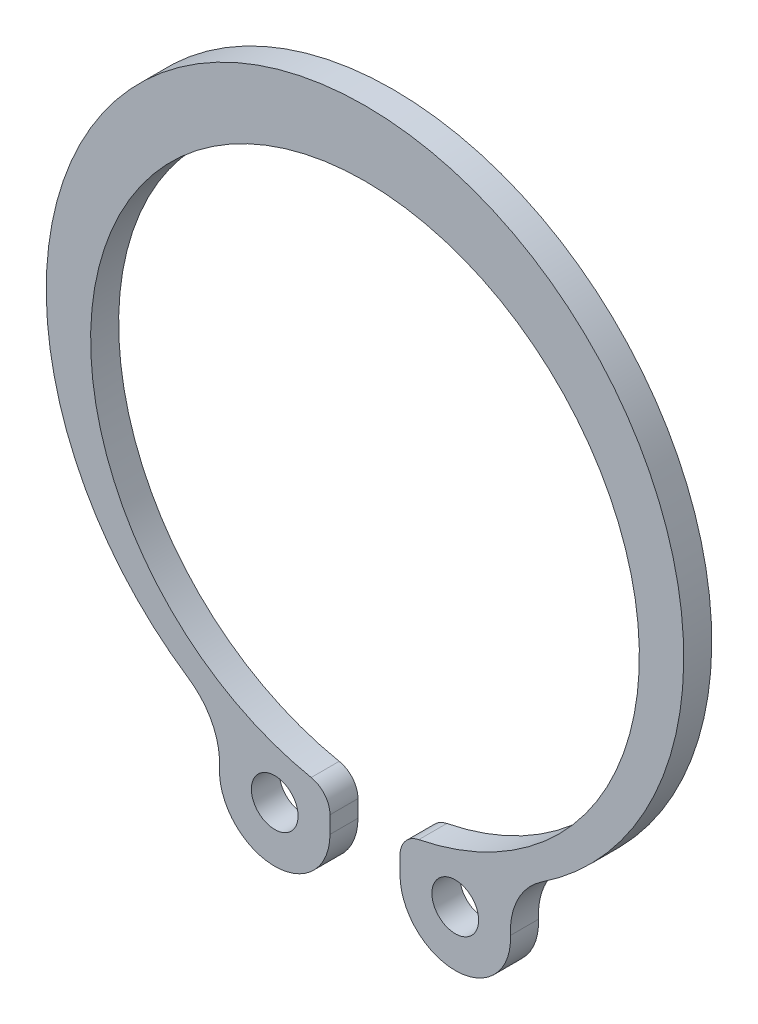
ISO-10303-21;
HEADER;
FILE_DESCRIPTION(('STEP AP214'),'2;1');
FILE_NAME('part.step','',(''),(''),'','','');
FILE_SCHEMA(('AUTOMOTIVE_DESIGN { 1 0 10303 214 1 1 1 1 }'));
ENDSEC;
DATA;
#1=APPLICATION_CONTEXT('core data for automotive mechanical design processes');
#2=APPLICATION_PROTOCOL_DEFINITION('international standard','automotive_design',2000,#1);
#3=PRODUCT_CONTEXT('',#1,'mechanical');
#4=PRODUCT('Part','Part','',(#3));
#5=PRODUCT_RELATED_PRODUCT_CATEGORY('part','',(#4));
#6=PRODUCT_DEFINITION_FORMATION('','',#4);
#7=PRODUCT_DEFINITION_CONTEXT('part definition',#1,'design');
#8=PRODUCT_DEFINITION('design','',#6,#7);
#9=PRODUCT_DEFINITION_SHAPE('','',#8);
#10=(LENGTH_UNIT() NAMED_UNIT(*) SI_UNIT(.MILLI.,.METRE.));
#11=(NAMED_UNIT(*) PLANE_ANGLE_UNIT() SI_UNIT($,.RADIAN.));
#12=(NAMED_UNIT(*) SI_UNIT($,.STERADIAN.) SOLID_ANGLE_UNIT());
#13=UNCERTAINTY_MEASURE_WITH_UNIT(LENGTH_MEASURE(1.E-05),#10,'distance_accuracy_value','');
#14=(GEOMETRIC_REPRESENTATION_CONTEXT(3) GLOBAL_UNCERTAINTY_ASSIGNED_CONTEXT((#13)) GLOBAL_UNIT_ASSIGNED_CONTEXT((#10,
#11,#12)) REPRESENTATION_CONTEXT('',''));
#15=CARTESIAN_POINT('',(0.,0.,0.));
#16=DIRECTION('',(0.,0.,1.));
#17=DIRECTION('',(1.,0.,0.));
#18=AXIS2_PLACEMENT_3D('',#15,#16,#17);
#19=CARTESIAN_POINT('',(2.5,-13.40249975005,1.2));
#20=DIRECTION('',(0.,0.,1.));
#21=DIRECTION('',(1.,0.,0.));
#22=AXIS2_PLACEMENT_3D('',#19,#20,#21);
#23=PLANE('',#22);
#24=CARTESIAN_POINT('',(-3.86605014820735,-14.1306813795919,1.2));
#25=DIRECTION('',(0.,0.,1.));
#26=DIRECTION('',(1.,0.,0.));
#27=AXIS2_PLACEMENT_3D('',#24,#25,#26);
#28=CIRCLE('',#27,1.);
#29=CARTESIAN_POINT('',(-2.86605014820735,-14.1306813795919,1.2));
#30=VERTEX_POINT('',#29);
#31=EDGE_CURVE('E147',#30,#30,#28,.T.);
#32=ORIENTED_EDGE('',*,*,#31,.F.);
#33=EDGE_LOOP('',(#32));
#34=FACE_BOUND('',#33,.T.);
#35=CARTESIAN_POINT('',(2.5,-13.40249975005,1.2));
#36=DIRECTION('',(0.,0.,1.));
#37=DIRECTION('',(1.,0.,0.));
#38=AXIS2_PLACEMENT_3D('',#35,#36,#37);
#39=CIRCLE('',#38,1.);
#40=CARTESIAN_POINT('',(2.30392156862744,-12.4219115343598,1.2));
#41=VERTEX_POINT('',#40);
#42=CARTESIAN_POINT('',(1.5,-13.40249975005,1.2));
#43=VERTEX_POINT('',#42);
#44=EDGE_CURVE('E162',#41,#43,#39,.T.);
#45=ORIENTED_EDGE('',*,*,#44,.T.);
#46=DIRECTION('',(0.,-1.,0.));
#47=VECTOR('',#46,1.);
#48=CARTESIAN_POINT('',(1.5,-14.1306813795919,1.2));
#49=LINE('',#48,#47);
#50=CARTESIAN_POINT('',(1.5,-14.1306813795919,1.2));
#51=VERTEX_POINT('',#50);
#52=EDGE_CURVE('E100',#43,#51,#49,.T.);
#53=ORIENTED_EDGE('',*,*,#52,.T.);
#54=CARTESIAN_POINT('',(3.86605014820735,-14.1306813795919,1.2));
#55=DIRECTION('',(0.,0.,1.));
#56=DIRECTION('',(-1.,0.,0.));
#57=AXIS2_PLACEMENT_3D('',#54,#55,#56);
#58=CIRCLE('',#57,2.36605014820735);
#59=CARTESIAN_POINT('',(6.22910158052682,-14.0115964013413,1.2));
#60=VERTEX_POINT('',#59);
#61=EDGE_CURVE('E183',#51,#60,#58,.T.);
#62=ORIENTED_EDGE('',*,*,#61,.T.);
#63=CARTESIAN_POINT('',(9.22529940090249,-13.8606042784472,1.2));
#64=DIRECTION('',(0.,0.,-1.));
#65=DIRECTION('',(1.,0.,0.));
#66=AXIS2_PLACEMENT_3D('',#63,#64,#65);
#67=CIRCLE('',#66,3.);
#68=CARTESIAN_POINT('',(7.56308329263177,-11.3631981021504,1.2));
#69=VERTEX_POINT('',#68);
#70=EDGE_CURVE('E202',#60,#69,#67,.T.);
#71=ORIENTED_EDGE('',*,*,#70,.T.);
#72=CARTESIAN_POINT('',(0.,0.,1.2));
#73=DIRECTION('',(0.,0.,1.));
#74=DIRECTION('',(1.,0.,0.));
#75=AXIS2_PLACEMENT_3D('',#72,#73,#74);
#76=CIRCLE('',#75,13.65);
#77=CARTESIAN_POINT('',(-7.56308329263177,-11.3631981021504,1.2));
#78=VERTEX_POINT('',#77);
#79=EDGE_CURVE('E199',#69,#78,#76,.T.);
#80=ORIENTED_EDGE('',*,*,#79,.T.);
#81=CARTESIAN_POINT('',(-9.22529940090249,-13.8606042784472,1.2));
#82=DIRECTION('',(0.,0.,-1.));
#83=DIRECTION('',(-1.,0.,0.));
#84=AXIS2_PLACEMENT_3D('',#81,#82,#83);
#85=CIRCLE('',#84,3.);
#86=CARTESIAN_POINT('',(-6.22910158052682,-14.0115964013413,1.2));
#87=VERTEX_POINT('',#86);
#88=EDGE_CURVE('E201',#78,#87,#85,.T.);
#89=ORIENTED_EDGE('',*,*,#88,.T.);
#90=CARTESIAN_POINT('',(-3.86605014820735,-14.1306813795919,1.2));
#91=DIRECTION('',(0.,0.,1.));
#92=DIRECTION('',(1.,0.,0.));
#93=AXIS2_PLACEMENT_3D('',#90,#91,#92);
#94=CIRCLE('',#93,2.36605014820735);
#95=CARTESIAN_POINT('',(-1.5,-14.1306813795919,1.2));
#96=VERTEX_POINT('',#95);
#97=EDGE_CURVE('E125',#87,#96,#94,.T.);
#98=ORIENTED_EDGE('',*,*,#97,.T.);
#99=DIRECTION('',(0.,1.,0.));
#100=VECTOR('',#99,1.);
#101=CARTESIAN_POINT('',(-1.5,-14.1306813795919,1.2));
#102=LINE('',#101,#100);
#103=CARTESIAN_POINT('',(-1.5,-13.40249975005,1.2));
#104=VERTEX_POINT('',#103);
#105=EDGE_CURVE('E119',#96,#104,#102,.T.);
#106=ORIENTED_EDGE('',*,*,#105,.T.);
#107=CARTESIAN_POINT('',(-2.5,-13.40249975005,1.2));
#108=DIRECTION('',(0.,0.,1.));
#109=DIRECTION('',(-1.,0.,0.));
#110=AXIS2_PLACEMENT_3D('',#107,#108,#109);
#111=CIRCLE('',#110,1.);
#112=CARTESIAN_POINT('',(-2.30392156862746,-12.4219115343598,1.2));
#113=VERTEX_POINT('',#112);
#114=EDGE_CURVE('E123',#104,#113,#111,.T.);
#115=ORIENTED_EDGE('',*,*,#114,.T.);
#116=CARTESIAN_POINT('',(0.,-0.9,1.2));
#117=DIRECTION('',(0.,0.,-1.));
#118=DIRECTION('',(1.,0.,0.));
#119=AXIS2_PLACEMENT_3D('',#116,#117,#118);
#120=CIRCLE('',#119,11.75);
#121=EDGE_CURVE('E51',#113,#41,#120,.T.);
#122=ORIENTED_EDGE('',*,*,#121,.T.);
#123=EDGE_LOOP('',(#45,#53,#62,#71,#80,#89,#98,#106,#115,#122));
#124=FACE_BOUND('',#123,.T.);
#125=CARTESIAN_POINT('',(3.86605014820735,-14.1306813795919,1.2));
#126=DIRECTION('',(0.,0.,1.));
#127=DIRECTION('',(-1.,0.,0.));
#128=AXIS2_PLACEMENT_3D('',#125,#126,#127);
#129=CIRCLE('',#128,1.);
#130=CARTESIAN_POINT('',(2.86605014820735,-14.1306813795919,1.2));
#131=VERTEX_POINT('',#130);
#132=EDGE_CURVE('E213',#131,#131,#129,.T.);
#133=ORIENTED_EDGE('',*,*,#132,.F.);
#134=EDGE_LOOP('',(#133));
#135=FACE_BOUND('',#134,.T.);
#136=ADVANCED_FACE('F34',(#34,#124,#135),#23,.T.);
#137=CARTESIAN_POINT('',(2.5,-13.40249975005,0.));
#138=DIRECTION('',(0.,0.,1.));
#139=DIRECTION('',(1.,0.,0.));
#140=AXIS2_PLACEMENT_3D('',#137,#138,#139);
#141=PLANE('',#140);
#142=CARTESIAN_POINT('',(2.5,-13.40249975005,0.));
#143=DIRECTION('',(0.,0.,1.));
#144=DIRECTION('',(1.,0.,0.));
#145=AXIS2_PLACEMENT_3D('',#142,#143,#144);
#146=CIRCLE('',#145,1.);
#147=CARTESIAN_POINT('',(2.30392156862744,-12.4219115343598,0.));
#148=VERTEX_POINT('',#147);
#149=CARTESIAN_POINT('',(1.5,-13.40249975005,0.));
#150=VERTEX_POINT('',#149);
#151=EDGE_CURVE('E143',#148,#150,#146,.T.);
#152=ORIENTED_EDGE('',*,*,#151,.F.);
#153=CARTESIAN_POINT('',(0.,-0.9,0.));
#154=DIRECTION('',(0.,0.,-1.));
#155=DIRECTION('',(1.,0.,0.));
#156=AXIS2_PLACEMENT_3D('',#153,#154,#155);
#157=CIRCLE('',#156,11.75);
#158=CARTESIAN_POINT('',(-2.30392156862746,-12.4219115343598,0.));
#159=VERTEX_POINT('',#158);
#160=EDGE_CURVE('E92',#159,#148,#157,.T.);
#161=ORIENTED_EDGE('',*,*,#160,.F.);
#162=CARTESIAN_POINT('',(-2.5,-13.40249975005,0.));
#163=DIRECTION('',(0.,0.,1.));
#164=DIRECTION('',(-1.,0.,0.));
#165=AXIS2_PLACEMENT_3D('',#162,#163,#164);
#166=CIRCLE('',#165,1.);
#167=CARTESIAN_POINT('',(-1.5,-13.40249975005,0.));
#168=VERTEX_POINT('',#167);
#169=EDGE_CURVE('E86',#168,#159,#166,.T.);
#170=ORIENTED_EDGE('',*,*,#169,.F.);
#171=DIRECTION('',(0.,1.,0.));
#172=VECTOR('',#171,1.);
#173=CARTESIAN_POINT('',(-1.5,-14.1306813795919,0.));
#174=LINE('',#173,#172);
#175=CARTESIAN_POINT('',(-1.5,-14.1306813795919,0.));
#176=VERTEX_POINT('',#175);
#177=EDGE_CURVE('E133',#176,#168,#174,.T.);
#178=ORIENTED_EDGE('',*,*,#177,.F.);
#179=CARTESIAN_POINT('',(-3.86605014820735,-14.1306813795919,0.));
#180=DIRECTION('',(0.,0.,1.));
#181=DIRECTION('',(1.,0.,0.));
#182=AXIS2_PLACEMENT_3D('',#179,#180,#181);
#183=CIRCLE('',#182,2.36605014820735);
#184=CARTESIAN_POINT('',(-6.22910158052682,-14.0115964013413,0.));
#185=VERTEX_POINT('',#184);
#186=EDGE_CURVE('E157',#185,#176,#183,.T.);
#187=ORIENTED_EDGE('',*,*,#186,.F.);
#188=CARTESIAN_POINT('',(-9.22529940090249,-13.8606042784472,0.));
#189=DIRECTION('',(0.,0.,-1.));
#190=DIRECTION('',(-1.,0.,0.));
#191=AXIS2_PLACEMENT_3D('',#188,#189,#190);
#192=CIRCLE('',#191,3.);
#193=CARTESIAN_POINT('',(-7.56308329263177,-11.3631981021504,0.));
#194=VERTEX_POINT('',#193);
#195=EDGE_CURVE('E155',#194,#185,#192,.T.);
#196=ORIENTED_EDGE('',*,*,#195,.F.);
#197=CARTESIAN_POINT('',(0.,0.,0.));
#198=DIRECTION('',(0.,0.,1.));
#199=DIRECTION('',(1.,0.,0.));
#200=AXIS2_PLACEMENT_3D('',#197,#198,#199);
#201=CIRCLE('',#200,13.65);
#202=CARTESIAN_POINT('',(7.56308329263177,-11.3631981021504,0.));
#203=VERTEX_POINT('',#202);
#204=EDGE_CURVE('E153',#203,#194,#201,.T.);
#205=ORIENTED_EDGE('',*,*,#204,.F.);
#206=CARTESIAN_POINT('',(9.22529940090249,-13.8606042784472,0.));
#207=DIRECTION('',(0.,0.,-1.));
#208=DIRECTION('',(1.,0.,0.));
#209=AXIS2_PLACEMENT_3D('',#206,#207,#208);
#210=CIRCLE('',#209,3.);
#211=CARTESIAN_POINT('',(6.22910158052682,-14.0115964013413,0.));
#212=VERTEX_POINT('',#211);
#213=EDGE_CURVE('E151',#212,#203,#210,.T.);
#214=ORIENTED_EDGE('',*,*,#213,.F.);
#215=CARTESIAN_POINT('',(3.86605014820735,-14.1306813795919,0.));
#216=DIRECTION('',(0.,0.,1.));
#217=DIRECTION('',(-1.,0.,0.));
#218=AXIS2_PLACEMENT_3D('',#215,#216,#217);
#219=CIRCLE('',#218,2.36605014820735);
#220=CARTESIAN_POINT('',(1.5,-14.1306813795919,0.));
#221=VERTEX_POINT('',#220);
#222=EDGE_CURVE('E149',#221,#212,#219,.T.);
#223=ORIENTED_EDGE('',*,*,#222,.F.);
#224=DIRECTION('',(0.,-1.,0.));
#225=VECTOR('',#224,1.);
#226=CARTESIAN_POINT('',(1.5,-14.1306813795919,0.));
#227=LINE('',#226,#225);
#228=EDGE_CURVE('E146',#150,#221,#227,.T.);
#229=ORIENTED_EDGE('',*,*,#228,.F.);
#230=EDGE_LOOP('',(#152,#161,#170,#178,#187,#196,#205,#214,#223,#229));
#231=FACE_BOUND('',#230,.T.);
#232=CARTESIAN_POINT('',(-3.86605014820735,-14.1306813795919,0.));
#233=DIRECTION('',(0.,0.,1.));
#234=DIRECTION('',(1.,0.,0.));
#235=AXIS2_PLACEMENT_3D('',#232,#233,#234);
#236=CIRCLE('',#235,1.);
#237=CARTESIAN_POINT('',(-2.86605014820735,-14.1306813795919,0.));
#238=VERTEX_POINT('',#237);
#239=EDGE_CURVE('E210',#238,#238,#236,.T.);
#240=ORIENTED_EDGE('',*,*,#239,.T.);
#241=EDGE_LOOP('',(#240));
#242=FACE_BOUND('',#241,.T.);
#243=CARTESIAN_POINT('',(3.86605014820735,-14.1306813795919,0.));
#244=DIRECTION('',(0.,0.,1.));
#245=DIRECTION('',(-1.,0.,0.));
#246=AXIS2_PLACEMENT_3D('',#243,#244,#245);
#247=CIRCLE('',#246,1.);
#248=CARTESIAN_POINT('',(2.86605014820735,-14.1306813795919,0.));
#249=VERTEX_POINT('',#248);
#250=EDGE_CURVE('E216',#249,#249,#247,.T.);
#251=ORIENTED_EDGE('',*,*,#250,.T.);
#252=EDGE_LOOP('',(#251));
#253=FACE_BOUND('',#252,.T.);
#254=ADVANCED_FACE('F187',(#231,#242,#253),#141,.F.);
#255=CARTESIAN_POINT('',(2.5,-13.40249975005,1.2));
#256=DIRECTION('',(0.,0.,-1.));
#257=DIRECTION('',(-1.,0.,0.));
#258=AXIS2_PLACEMENT_3D('',#255,#256,#257);
#259=CYLINDRICAL_SURFACE('',#258,1.);
#260=ORIENTED_EDGE('',*,*,#151,.T.);
#261=DIRECTION('',(0.,0.,-1.));
#262=VECTOR('',#261,1.);
#263=CARTESIAN_POINT('',(1.5,-13.40249975005,1.2));
#264=LINE('',#263,#262);
#265=EDGE_CURVE('E11',#43,#150,#264,.T.);
#266=ORIENTED_EDGE('',*,*,#265,.F.);
#267=ORIENTED_EDGE('',*,*,#44,.F.);
#268=DIRECTION('',(0.,0.,-1.));
#269=VECTOR('',#268,1.);
#270=CARTESIAN_POINT('',(2.30392156862744,-12.4219115343598,1.2));
#271=LINE('',#270,#269);
#272=EDGE_CURVE('E139',#41,#148,#271,.T.);
#273=ORIENTED_EDGE('',*,*,#272,.T.);
#274=EDGE_LOOP('',(#260,#266,#267,#273));
#275=FACE_BOUND('',#274,.T.);
#276=ADVANCED_FACE('F36',(#275),#259,.T.);
#277=CARTESIAN_POINT('',(1.5,-14.1306813795919,1.2));
#278=DIRECTION('',(1.,0.,0.));
#279=DIRECTION('',(0.,0.,-1.));
#280=AXIS2_PLACEMENT_3D('',#277,#278,#279);
#281=PLANE('',#280);
#282=ORIENTED_EDGE('',*,*,#228,.T.);
#283=DIRECTION('',(0.,0.,-1.));
#284=VECTOR('',#283,1.);
#285=CARTESIAN_POINT('',(1.5,-14.1306813795919,1.2));
#286=LINE('',#285,#284);
#287=EDGE_CURVE('E43',#51,#221,#286,.T.);
#288=ORIENTED_EDGE('',*,*,#287,.F.);
#289=ORIENTED_EDGE('',*,*,#52,.F.);
#290=ORIENTED_EDGE('',*,*,#265,.T.);
#291=EDGE_LOOP('',(#282,#288,#289,#290));
#292=FACE_BOUND('',#291,.T.);
#293=ADVANCED_FACE('F256',(#292),#281,.F.);
#294=CARTESIAN_POINT('',(3.86605014820735,-14.1306813795919,1.2));
#295=DIRECTION('',(0.,0.,-1.));
#296=DIRECTION('',(-1.,0.,0.));
#297=AXIS2_PLACEMENT_3D('',#294,#295,#296);
#298=CYLINDRICAL_SURFACE('',#297,2.36605014820735);
#299=ORIENTED_EDGE('',*,*,#222,.T.);
#300=DIRECTION('',(0.,0.,-1.));
#301=VECTOR('',#300,1.);
#302=CARTESIAN_POINT('',(6.22910158052682,-14.0115964013413,1.2));
#303=LINE('',#302,#301);
#304=EDGE_CURVE('E175',#60,#212,#303,.T.);
#305=ORIENTED_EDGE('',*,*,#304,.F.);
#306=ORIENTED_EDGE('',*,*,#61,.F.);
#307=ORIENTED_EDGE('',*,*,#287,.T.);
#308=EDGE_LOOP('',(#299,#305,#306,#307));
#309=FACE_BOUND('',#308,.T.);
#310=ADVANCED_FACE('F181',(#309),#298,.T.);
#311=CARTESIAN_POINT('',(9.22529940090249,-13.8606042784472,1.2));
#312=DIRECTION('',(0.,0.,-1.));
#313=DIRECTION('',(-1.,0.,0.));
#314=AXIS2_PLACEMENT_3D('',#311,#312,#313);
#315=CYLINDRICAL_SURFACE('',#314,3.);
#316=ORIENTED_EDGE('',*,*,#213,.T.);
#317=DIRECTION('',(0.,0.,-1.));
#318=VECTOR('',#317,1.);
#319=CARTESIAN_POINT('',(7.56308329263177,-11.3631981021504,1.2));
#320=LINE('',#319,#318);
#321=EDGE_CURVE('E172',#69,#203,#320,.T.);
#322=ORIENTED_EDGE('',*,*,#321,.F.);
#323=ORIENTED_EDGE('',*,*,#70,.F.);
#324=ORIENTED_EDGE('',*,*,#304,.T.);
#325=EDGE_LOOP('',(#316,#322,#323,#324));
#326=FACE_BOUND('',#325,.T.);
#327=ADVANCED_FACE('F193',(#326),#315,.F.);
#328=CARTESIAN_POINT('',(0.,0.,1.2));
#329=DIRECTION('',(0.,0.,-1.));
#330=DIRECTION('',(-1.,0.,0.));
#331=AXIS2_PLACEMENT_3D('',#328,#329,#330);
#332=CYLINDRICAL_SURFACE('',#331,13.65);
#333=ORIENTED_EDGE('',*,*,#204,.T.);
#334=DIRECTION('',(0.,0.,-1.));
#335=VECTOR('',#334,1.);
#336=CARTESIAN_POINT('',(-7.56308329263177,-11.3631981021504,1.2));
#337=LINE('',#336,#335);
#338=EDGE_CURVE('E169',#78,#194,#337,.T.);
#339=ORIENTED_EDGE('',*,*,#338,.F.);
#340=ORIENTED_EDGE('',*,*,#79,.F.);
#341=ORIENTED_EDGE('',*,*,#321,.T.);
#342=EDGE_LOOP('',(#333,#339,#340,#341));
#343=FACE_BOUND('',#342,.T.);
#344=ADVANCED_FACE('F197',(#343),#332,.T.);
#345=CARTESIAN_POINT('',(-9.22529940090249,-13.8606042784472,1.2));
#346=DIRECTION('',(0.,0.,-1.));
#347=DIRECTION('',(-1.,0.,0.));
#348=AXIS2_PLACEMENT_3D('',#345,#346,#347);
#349=CYLINDRICAL_SURFACE('',#348,3.);
#350=ORIENTED_EDGE('',*,*,#195,.T.);
#351=DIRECTION('',(0.,0.,-1.));
#352=VECTOR('',#351,1.);
#353=CARTESIAN_POINT('',(-6.22910158052682,-14.0115964013413,1.2));
#354=LINE('',#353,#352);
#355=EDGE_CURVE('E166',#87,#185,#354,.T.);
#356=ORIENTED_EDGE('',*,*,#355,.F.);
#357=ORIENTED_EDGE('',*,*,#88,.F.);
#358=ORIENTED_EDGE('',*,*,#338,.T.);
#359=EDGE_LOOP('',(#350,#356,#357,#358));
#360=FACE_BOUND('',#359,.T.);
#361=ADVANCED_FACE('F246',(#360),#349,.F.);
#362=CARTESIAN_POINT('',(-3.86605014820735,-14.1306813795919,1.2));
#363=DIRECTION('',(0.,0.,-1.));
#364=DIRECTION('',(-1.,0.,0.));
#365=AXIS2_PLACEMENT_3D('',#362,#363,#364);
#366=CYLINDRICAL_SURFACE('',#365,2.36605014820735);
#367=ORIENTED_EDGE('',*,*,#186,.T.);
#368=DIRECTION('',(0.,0.,-1.));
#369=VECTOR('',#368,1.);
#370=CARTESIAN_POINT('',(-1.5,-14.1306813795919,1.2));
#371=LINE('',#370,#369);
#372=EDGE_CURVE('E134',#96,#176,#371,.T.);
#373=ORIENTED_EDGE('',*,*,#372,.F.);
#374=ORIENTED_EDGE('',*,*,#97,.F.);
#375=ORIENTED_EDGE('',*,*,#355,.T.);
#376=EDGE_LOOP('',(#367,#373,#374,#375));
#377=FACE_BOUND('',#376,.T.);
#378=ADVANCED_FACE('F243',(#377),#366,.T.);
#379=CARTESIAN_POINT('',(-1.5,-14.1306813795919,1.2));
#380=DIRECTION('',(-1.,0.,0.));
#381=DIRECTION('',(0.,0.,1.));
#382=AXIS2_PLACEMENT_3D('',#379,#380,#381);
#383=PLANE('',#382);
#384=ORIENTED_EDGE('',*,*,#177,.T.);
#385=DIRECTION('',(0.,0.,-1.));
#386=VECTOR('',#385,1.);
#387=CARTESIAN_POINT('',(-1.5,-13.40249975005,1.2));
#388=LINE('',#387,#386);
#389=EDGE_CURVE('E130',#104,#168,#388,.T.);
#390=ORIENTED_EDGE('',*,*,#389,.F.);
#391=ORIENTED_EDGE('',*,*,#105,.F.);
#392=ORIENTED_EDGE('',*,*,#372,.T.);
#393=EDGE_LOOP('',(#384,#390,#391,#392));
#394=FACE_BOUND('',#393,.T.);
#395=ADVANCED_FACE('F131',(#394),#383,.F.);
#396=CARTESIAN_POINT('',(-2.5,-13.40249975005,1.2));
#397=DIRECTION('',(0.,0.,-1.));
#398=DIRECTION('',(-1.,0.,0.));
#399=AXIS2_PLACEMENT_3D('',#396,#397,#398);
#400=CYLINDRICAL_SURFACE('',#399,1.);
#401=ORIENTED_EDGE('',*,*,#169,.T.);
#402=DIRECTION('',(0.,0.,-1.));
#403=VECTOR('',#402,1.);
#404=CARTESIAN_POINT('',(-2.30392156862746,-12.4219115343598,1.2));
#405=LINE('',#404,#403);
#406=EDGE_CURVE('E135',#113,#159,#405,.T.);
#407=ORIENTED_EDGE('',*,*,#406,.F.);
#408=ORIENTED_EDGE('',*,*,#114,.F.);
#409=ORIENTED_EDGE('',*,*,#389,.T.);
#410=EDGE_LOOP('',(#401,#407,#408,#409));
#411=FACE_BOUND('',#410,.T.);
#412=ADVANCED_FACE('F137',(#411),#400,.T.);
#413=CARTESIAN_POINT('',(0.,-0.9,1.2));
#414=DIRECTION('',(0.,0.,-1.));
#415=DIRECTION('',(-1.,0.,0.));
#416=AXIS2_PLACEMENT_3D('',#413,#414,#415);
#417=CYLINDRICAL_SURFACE('',#416,11.75);
#418=ORIENTED_EDGE('',*,*,#160,.T.);
#419=ORIENTED_EDGE('',*,*,#272,.F.);
#420=ORIENTED_EDGE('',*,*,#121,.F.);
#421=ORIENTED_EDGE('',*,*,#406,.T.);
#422=EDGE_LOOP('',(#418,#419,#420,#421));
#423=FACE_BOUND('',#422,.T.);
#424=ADVANCED_FACE('F236',(#423),#417,.F.);
#425=CARTESIAN_POINT('',(-3.86605014820735,-14.1306813795919,1.2));
#426=DIRECTION('',(0.,0.,-1.));
#427=DIRECTION('',(-1.,0.,0.));
#428=AXIS2_PLACEMENT_3D('',#425,#426,#427);
#429=CYLINDRICAL_SURFACE('',#428,1.);
#430=ORIENTED_EDGE('',*,*,#31,.T.);
#431=EDGE_LOOP('',(#430));
#432=FACE_BOUND('',#431,.T.);
#433=ORIENTED_EDGE('',*,*,#239,.F.);
#434=EDGE_LOOP('',(#433));
#435=FACE_BOUND('',#434,.T.);
#436=ADVANCED_FACE('F233',(#432,#435),#429,.F.);
#437=CARTESIAN_POINT('',(3.86605014820735,-14.1306813795919,1.2));
#438=DIRECTION('',(0.,0.,-1.));
#439=DIRECTION('',(-1.,0.,0.));
#440=AXIS2_PLACEMENT_3D('',#437,#438,#439);
#441=CYLINDRICAL_SURFACE('',#440,1.);
#442=ORIENTED_EDGE('',*,*,#132,.T.);
#443=EDGE_LOOP('',(#442));
#444=FACE_BOUND('',#443,.T.);
#445=ORIENTED_EDGE('',*,*,#250,.F.);
#446=EDGE_LOOP('',(#445));
#447=FACE_BOUND('',#446,.T.);
#448=ADVANCED_FACE('F222',(#444,#447),#441,.F.);
#449=CLOSED_SHELL('',(#136,#254,#276,#293,#310,#327,#344,#361,#378,#395,#412,#424,#436,#448));
#450=MANIFOLD_SOLID_BREP('B2',#449);
#451=ADVANCED_BREP_SHAPE_REPRESENTATION('',(#18,#450),#14);
#452=SHAPE_DEFINITION_REPRESENTATION(#9,#451);
ENDSEC;
END-ISO-10303-21;
